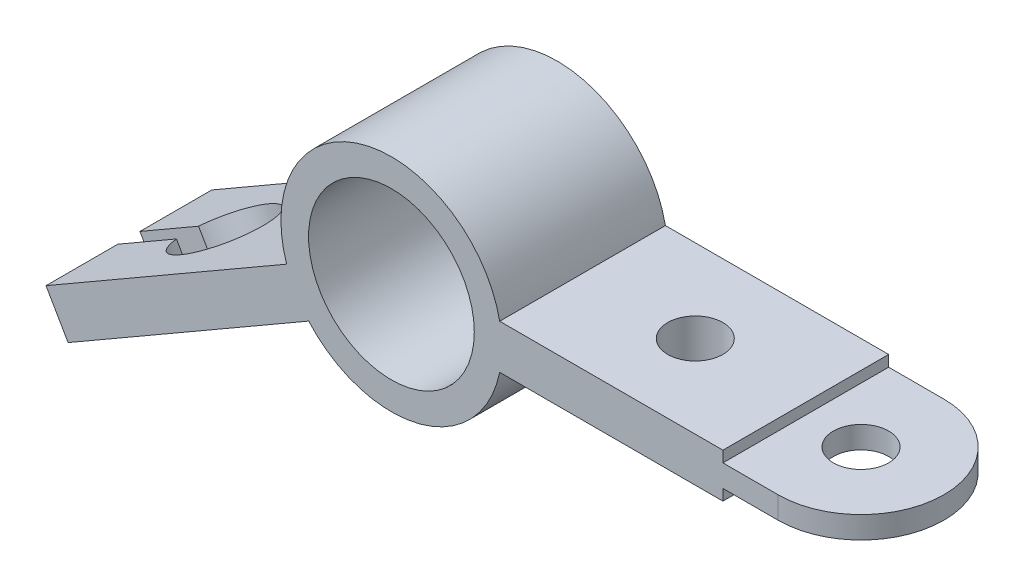
ISO-10303-21;
HEADER;
FILE_DESCRIPTION(('STEP AP214'),'2;1');
FILE_NAME('part.step','',(''),(''),'','','');
FILE_SCHEMA(('AUTOMOTIVE_DESIGN { 1 0 10303 214 1 1 1 1 }'));
ENDSEC;
DATA;
#1=APPLICATION_CONTEXT('core data for automotive mechanical design processes');
#2=APPLICATION_PROTOCOL_DEFINITION('international standard','automotive_design',2000,#1);
#3=PRODUCT_CONTEXT('',#1,'mechanical');
#4=PRODUCT('Part','Part','',(#3));
#5=PRODUCT_RELATED_PRODUCT_CATEGORY('part','',(#4));
#6=PRODUCT_DEFINITION_FORMATION('','',#4);
#7=PRODUCT_DEFINITION_CONTEXT('part definition',#1,'design');
#8=PRODUCT_DEFINITION('design','',#6,#7);
#9=PRODUCT_DEFINITION_SHAPE('','',#8);
#10=(LENGTH_UNIT() NAMED_UNIT(*) SI_UNIT(.MILLI.,.METRE.));
#11=(NAMED_UNIT(*) PLANE_ANGLE_UNIT() SI_UNIT($,.RADIAN.));
#12=(NAMED_UNIT(*) SI_UNIT($,.STERADIAN.) SOLID_ANGLE_UNIT());
#13=UNCERTAINTY_MEASURE_WITH_UNIT(LENGTH_MEASURE(1.E-05),#10,'distance_accuracy_value','');
#14=(GEOMETRIC_REPRESENTATION_CONTEXT(3) GLOBAL_UNCERTAINTY_ASSIGNED_CONTEXT((#13)) GLOBAL_UNIT_ASSIGNED_CONTEXT((#10,
#11,#12)) REPRESENTATION_CONTEXT('',''));
#15=CARTESIAN_POINT('',(0.,0.,0.));
#16=DIRECTION('',(0.,0.,1.));
#17=DIRECTION('',(1.,0.,0.));
#18=AXIS2_PLACEMENT_3D('',#15,#16,#17);
#19=CARTESIAN_POINT('',(-151.30680751374,-87.357026048281,37.5));
#20=DIRECTION('',(-0.866025403784438,-0.500000000000002,0.));
#21=DIRECTION('',(0.500000000000002,-0.866025403784438,0.));
#22=AXIS2_PLACEMENT_3D('',#19,#20,#21);
#23=PLANE('',#22);
#24=DIRECTION('',(0.,0.,-1.));
#25=VECTOR('',#24,1.);
#26=CARTESIAN_POINT('',(-146.30680751374,-96.0172800861254,37.5));
#27=LINE('',#26,#25);
#28=CARTESIAN_POINT('',(-146.30680751374,-96.0172800861254,-5.));
#29=VERTEX_POINT('',#28);
#30=CARTESIAN_POINT('',(-146.30680751374,-96.0172800861254,-37.5));
#31=VERTEX_POINT('',#30);
#32=EDGE_CURVE('E114',#29,#31,#27,.T.);
#33=ORIENTED_EDGE('',*,*,#32,.F.);
#34=DIRECTION('',(-0.500000000000002,0.866025403784438,0.));
#35=VECTOR('',#34,1.);
#36=CARTESIAN_POINT('',(-151.30680751374,-87.357026048281,-5.));
#37=LINE('',#36,#35);
#38=CARTESIAN_POINT('',(-156.30680751374,-78.6967720104366,-5.));
#39=VERTEX_POINT('',#38);
#40=EDGE_CURVE('E54',#29,#39,#37,.T.);
#41=ORIENTED_EDGE('',*,*,#40,.T.);
#42=DIRECTION('',(0.,0.,-1.));
#43=VECTOR('',#42,1.);
#44=CARTESIAN_POINT('',(-156.30680751374,-78.6967720104366,37.5));
#45=LINE('',#44,#43);
#46=CARTESIAN_POINT('',(-156.30680751374,-78.6967720104366,-37.5));
#47=VERTEX_POINT('',#46);
#48=EDGE_CURVE('E234',#39,#47,#45,.T.);
#49=ORIENTED_EDGE('',*,*,#48,.T.);
#50=DIRECTION('',(-0.500000000000002,0.866025403784438,0.));
#51=VECTOR('',#50,1.);
#52=CARTESIAN_POINT('',(-151.30680751374,-87.357026048281,-37.5));
#53=LINE('',#52,#51);
#54=EDGE_CURVE('E223',#31,#47,#53,.T.);
#55=ORIENTED_EDGE('',*,*,#54,.F.);
#56=EDGE_LOOP('',(#33,#41,#49,#55));
#57=FACE_BOUND('',#56,.T.);
#58=ADVANCED_FACE('F45',(#57),#23,.T.);
#59=CARTESIAN_POINT('',(4.99999999999999,-8.66025403784434,37.5));
#60=DIRECTION('',(-0.500000000000002,0.866025403784438,0.));
#61=DIRECTION('',(-0.866025403784438,-0.500000000000002,0.));
#62=AXIS2_PLACEMENT_3D('',#59,#60,#61);
#63=PLANE('',#62);
#64=CARTESIAN_POINT('',(-146.30680751374,-96.0172800861254,37.5));
#65=VERTEX_POINT('',#64);
#66=CARTESIAN_POINT('',(-146.30680751374,-96.0172800861254,5.));
#67=VERTEX_POINT('',#66);
#68=EDGE_CURVE('E70',#65,#67,#27,.T.);
#69=ORIENTED_EDGE('',*,*,#68,.T.);
#70=DIRECTION('',(0.866025403784438,0.500000000000002,0.));
#71=VECTOR('',#70,1.);
#72=CARTESIAN_POINT('',(4.99999999999999,-8.66025403784434,5.));
#73=LINE('',#72,#71);
#74=CARTESIAN_POINT('',(-119.776047155766,-80.6997384516438,5.));
#75=VERTEX_POINT('',#74);
#76=EDGE_CURVE('E342',#67,#75,#73,.T.);
#77=ORIENTED_EDGE('',*,*,#76,.T.);
#78=CARTESIAN_POINT('',(-103.005537324518,-71.0172800861253,0.));
#79=DIRECTION('',(-0.500000000000002,0.866025403784438,0.));
#80=DIRECTION('',(-0.866025403784438,-0.500000000000002,0.));
#81=AXIS2_PLACEMENT_3D('',#78,#79,#80);
#82=CIRCLE('',#81,20.);
#83=CARTESIAN_POINT('',(-119.776047155766,-80.6997384516438,-5.00000000000001));
#84=VERTEX_POINT('',#83);
#85=EDGE_CURVE('E338',#75,#84,#82,.T.);
#86=ORIENTED_EDGE('',*,*,#85,.T.);
#87=DIRECTION('',(0.866025403784438,0.500000000000002,0.));
#88=VECTOR('',#87,1.);
#89=CARTESIAN_POINT('',(4.99999999999999,-8.66025403784434,-5.));
#90=LINE('',#89,#88);
#91=EDGE_CURVE('E346',#29,#84,#90,.T.);
#92=ORIENTED_EDGE('',*,*,#91,.F.);
#93=ORIENTED_EDGE('',*,*,#32,.T.);
#94=DIRECTION('',(0.866025403784438,0.500000000000002,0.));
#95=VECTOR('',#94,1.);
#96=CARTESIAN_POINT('',(4.99999999999999,-8.66025403784434,-37.5));
#97=LINE('',#96,#95);
#98=CARTESIAN_POINT('',(-37.4264068711928,-33.1551514656762,-37.5));
#99=VERTEX_POINT('',#98);
#100=EDGE_CURVE('E189',#31,#99,#97,.T.);
#101=ORIENTED_EDGE('',*,*,#100,.T.);
#102=DIRECTION('',(0.,0.,-1.));
#103=VECTOR('',#102,1.);
#104=CARTESIAN_POINT('',(-37.4264068711928,-33.1551514656762,37.5));
#105=LINE('',#104,#103);
#106=CARTESIAN_POINT('',(-37.4264068711928,-33.1551514656762,37.5));
#107=VERTEX_POINT('',#106);
#108=EDGE_CURVE('E256',#107,#99,#105,.T.);
#109=ORIENTED_EDGE('',*,*,#108,.F.);
#110=DIRECTION('',(0.866025403784438,0.500000000000002,0.));
#111=VECTOR('',#110,1.);
#112=CARTESIAN_POINT('',(4.99999999999999,-8.66025403784434,37.5));
#113=LINE('',#112,#111);
#114=EDGE_CURVE('E231',#65,#107,#113,.T.);
#115=ORIENTED_EDGE('',*,*,#114,.F.);
#116=EDGE_LOOP('',(#69,#77,#86,#92,#93,#101,#109,#115));
#117=FACE_BOUND('',#116,.T.);
#118=ADVANCED_FACE('F47',(#117),#63,.F.);
#119=CARTESIAN_POINT('',(0.,0.,37.5));
#120=DIRECTION('',(0.,0.,-1.));
#121=DIRECTION('',(-1.,0.,0.));
#122=AXIS2_PLACEMENT_3D('',#119,#120,#121);
#123=CYLINDRICAL_SURFACE('',#122,50.);
#124=CARTESIAN_POINT('',(0.,0.,-37.5));
#125=DIRECTION('',(0.,0.,1.));
#126=DIRECTION('',(1.,0.,0.));
#127=AXIS2_PLACEMENT_3D('',#124,#125,#126);
#128=CIRCLE('',#127,50.);
#129=CARTESIAN_POINT('',(48.9897948556636,-10.,-37.5));
#130=VERTEX_POINT('',#129);
#131=EDGE_CURVE('E192',#99,#130,#128,.T.);
#132=ORIENTED_EDGE('',*,*,#131,.T.);
#133=DIRECTION('',(0.,0.,-1.));
#134=VECTOR('',#133,1.);
#135=CARTESIAN_POINT('',(48.9897948556636,-10.,37.5));
#136=LINE('',#135,#134);
#137=CARTESIAN_POINT('',(48.9897948556636,-10.,37.5));
#138=VERTEX_POINT('',#137);
#139=EDGE_CURVE('E253',#138,#130,#136,.T.);
#140=ORIENTED_EDGE('',*,*,#139,.F.);
#141=CARTESIAN_POINT('',(0.,0.,37.5));
#142=DIRECTION('',(0.,0.,1.));
#143=DIRECTION('',(1.,0.,0.));
#144=AXIS2_PLACEMENT_3D('',#141,#142,#143);
#145=CIRCLE('',#144,50.);
#146=EDGE_CURVE('E123',#107,#138,#145,.T.);
#147=ORIENTED_EDGE('',*,*,#146,.F.);
#148=ORIENTED_EDGE('',*,*,#108,.T.);
#149=EDGE_LOOP('',(#132,#140,#147,#148));
#150=FACE_BOUND('',#149,.T.);
#151=ADVANCED_FACE('F272',(#150),#123,.T.);
#152=CARTESIAN_POINT('',(0.,-10.,37.5));
#153=DIRECTION('',(0.,-1.,0.));
#154=DIRECTION('',(1.,0.,0.));
#155=AXIS2_PLACEMENT_3D('',#152,#153,#154);
#156=PLANE('',#155);
#157=CARTESIAN_POINT('',(100.,-10.,0.));
#158=DIRECTION('',(0.,-1.,0.));
#159=DIRECTION('',(1.,0.,0.));
#160=AXIS2_PLACEMENT_3D('',#157,#158,#159);
#161=CIRCLE('',#160,12.5);
#162=CARTESIAN_POINT('',(112.5,-10.,0.));
#163=VERTEX_POINT('',#162);
#164=EDGE_CURVE('E330',#163,#163,#161,.T.);
#165=ORIENTED_EDGE('',*,*,#164,.F.);
#166=EDGE_LOOP('',(#165));
#167=FACE_BOUND('',#166,.T.);
#168=DIRECTION('',(-1.,0.,0.));
#169=VECTOR('',#168,1.);
#170=CARTESIAN_POINT('',(0.,-10.,-37.5));
#171=LINE('',#170,#169);
#172=CARTESIAN_POINT('',(150.,-10.,-37.5));
#173=VERTEX_POINT('',#172);
#174=EDGE_CURVE('E197',#173,#130,#171,.T.);
#175=ORIENTED_EDGE('',*,*,#174,.F.);
#176=DIRECTION('',(0.,0.,-1.));
#177=VECTOR('',#176,1.);
#178=CARTESIAN_POINT('',(150.,-10.,37.5));
#179=LINE('',#178,#177);
#180=CARTESIAN_POINT('',(150.,-10.,37.5));
#181=VERTEX_POINT('',#180);
#182=EDGE_CURVE('E250',#181,#173,#179,.T.);
#183=ORIENTED_EDGE('',*,*,#182,.F.);
#184=DIRECTION('',(-1.,0.,0.));
#185=VECTOR('',#184,1.);
#186=CARTESIAN_POINT('',(0.,-10.,37.5));
#187=LINE('',#186,#185);
#188=EDGE_CURVE('E281',#181,#138,#187,.T.);
#189=ORIENTED_EDGE('',*,*,#188,.T.);
#190=ORIENTED_EDGE('',*,*,#139,.T.);
#191=EDGE_LOOP('',(#175,#183,#189,#190));
#192=FACE_BOUND('',#191,.T.);
#193=ADVANCED_FACE('F278',(#167,#192),#156,.T.);
#194=CARTESIAN_POINT('',(150.,0.,37.5));
#195=DIRECTION('',(-1.,0.,0.));
#196=DIRECTION('',(0.,0.,1.));
#197=AXIS2_PLACEMENT_3D('',#194,#195,#196);
#198=PLANE('',#197);
#199=DIRECTION('',(0.,1.,0.));
#200=VECTOR('',#199,1.);
#201=CARTESIAN_POINT('',(150.,0.,-37.5));
#202=LINE('',#201,#200);
#203=CARTESIAN_POINT('',(150.,-5.,-37.5));
#204=VERTEX_POINT('',#203);
#205=EDGE_CURVE('E201',#173,#204,#202,.T.);
#206=ORIENTED_EDGE('',*,*,#205,.T.);
#207=DIRECTION('',(0.,0.,-1.));
#208=VECTOR('',#207,1.);
#209=CARTESIAN_POINT('',(150.,-5.,37.5));
#210=LINE('',#209,#208);
#211=CARTESIAN_POINT('',(150.,-5.,37.5));
#212=VERTEX_POINT('',#211);
#213=EDGE_CURVE('E246',#212,#204,#210,.T.);
#214=ORIENTED_EDGE('',*,*,#213,.F.);
#215=DIRECTION('',(0.,1.,0.));
#216=VECTOR('',#215,1.);
#217=CARTESIAN_POINT('',(150.,0.,37.5));
#218=LINE('',#217,#216);
#219=EDGE_CURVE('E283',#181,#212,#218,.T.);
#220=ORIENTED_EDGE('',*,*,#219,.F.);
#221=ORIENTED_EDGE('',*,*,#182,.T.);
#222=EDGE_LOOP('',(#206,#214,#220,#221));
#223=FACE_BOUND('',#222,.T.);
#224=ADVANCED_FACE('F405',(#223),#198,.F.);
#225=CARTESIAN_POINT('',(0.,-5.,37.5));
#226=DIRECTION('',(0.,1.,0.));
#227=DIRECTION('',(0.,0.,1.));
#228=AXIS2_PLACEMENT_3D('',#225,#226,#227);
#229=PLANE('',#228);
#230=CARTESIAN_POINT('',(175.,-5.,0.));
#231=DIRECTION('',(0.,1.,0.));
#232=DIRECTION('',(0.,0.,1.));
#233=AXIS2_PLACEMENT_3D('',#230,#231,#232);
#234=CIRCLE('',#233,12.5);
#235=CARTESIAN_POINT('',(175.,-5.,12.5));
#236=VERTEX_POINT('',#235);
#237=EDGE_CURVE('E322',#236,#236,#234,.T.);
#238=ORIENTED_EDGE('',*,*,#237,.T.);
#239=EDGE_LOOP('',(#238));
#240=FACE_BOUND('',#239,.T.);
#241=DIRECTION('',(1.,0.,0.));
#242=VECTOR('',#241,1.);
#243=CARTESIAN_POINT('',(0.,-5.,-37.5));
#244=LINE('',#243,#242);
#245=CARTESIAN_POINT('',(175.,-5.,-37.5));
#246=VERTEX_POINT('',#245);
#247=EDGE_CURVE('E204',#204,#246,#244,.T.);
#248=ORIENTED_EDGE('',*,*,#247,.T.);
#249=CARTESIAN_POINT('',(175.,-5.,0.));
#250=DIRECTION('',(0.,1.,0.));
#251=DIRECTION('',(0.,0.,-1.));
#252=AXIS2_PLACEMENT_3D('',#249,#250,#251);
#253=CIRCLE('',#252,37.5);
#254=CARTESIAN_POINT('',(175.,-5.,37.5));
#255=VERTEX_POINT('',#254);
#256=EDGE_CURVE('E193',#255,#246,#253,.T.);
#257=ORIENTED_EDGE('',*,*,#256,.F.);
#258=DIRECTION('',(1.,0.,0.));
#259=VECTOR('',#258,1.);
#260=CARTESIAN_POINT('',(0.,-5.,37.5));
#261=LINE('',#260,#259);
#262=EDGE_CURVE('E287',#212,#255,#261,.T.);
#263=ORIENTED_EDGE('',*,*,#262,.F.);
#264=ORIENTED_EDGE('',*,*,#213,.T.);
#265=EDGE_LOOP('',(#248,#257,#263,#264));
#266=FACE_BOUND('',#265,.T.);
#267=ADVANCED_FACE('F395',(#240,#266),#229,.F.);
#268=CARTESIAN_POINT('',(0.,5.,37.5));
#269=DIRECTION('',(0.,1.,0.));
#270=DIRECTION('',(0.,0.,1.));
#271=AXIS2_PLACEMENT_3D('',#268,#269,#270);
#272=PLANE('',#271);
#273=CARTESIAN_POINT('',(175.,5.,0.));
#274=DIRECTION('',(0.,1.,0.));
#275=DIRECTION('',(0.,0.,1.));
#276=AXIS2_PLACEMENT_3D('',#273,#274,#275);
#277=CIRCLE('',#276,12.5);
#278=CARTESIAN_POINT('',(175.,5.,12.5));
#279=VERTEX_POINT('',#278);
#280=EDGE_CURVE('E326',#279,#279,#277,.T.);
#281=ORIENTED_EDGE('',*,*,#280,.F.);
#282=EDGE_LOOP('',(#281));
#283=FACE_BOUND('',#282,.T.);
#284=DIRECTION('',(1.,0.,0.));
#285=VECTOR('',#284,1.);
#286=CARTESIAN_POINT('',(0.,5.,-37.5));
#287=LINE('',#286,#285);
#288=CARTESIAN_POINT('',(150.,5.,-37.5));
#289=VERTEX_POINT('',#288);
#290=CARTESIAN_POINT('',(175.,5.,-37.5));
#291=VERTEX_POINT('',#290);
#292=EDGE_CURVE('E213',#289,#291,#287,.T.);
#293=ORIENTED_EDGE('',*,*,#292,.F.);
#294=DIRECTION('',(0.,0.,-1.));
#295=VECTOR('',#294,1.);
#296=CARTESIAN_POINT('',(150.,5.,37.5));
#297=LINE('',#296,#295);
#298=CARTESIAN_POINT('',(150.,5.,37.5));
#299=VERTEX_POINT('',#298);
#300=EDGE_CURVE('E243',#299,#289,#297,.T.);
#301=ORIENTED_EDGE('',*,*,#300,.F.);
#302=DIRECTION('',(1.,0.,0.));
#303=VECTOR('',#302,1.);
#304=CARTESIAN_POINT('',(0.,5.,37.5));
#305=LINE('',#304,#303);
#306=CARTESIAN_POINT('',(175.,5.,37.5));
#307=VERTEX_POINT('',#306);
#308=EDGE_CURVE('E298',#299,#307,#305,.T.);
#309=ORIENTED_EDGE('',*,*,#308,.T.);
#310=CARTESIAN_POINT('',(175.,5.,0.));
#311=DIRECTION('',(0.,1.,0.));
#312=DIRECTION('',(0.,0.,-1.));
#313=AXIS2_PLACEMENT_3D('',#310,#311,#312);
#314=CIRCLE('',#313,37.5);
#315=EDGE_CURVE('E319',#307,#291,#314,.T.);
#316=ORIENTED_EDGE('',*,*,#315,.T.);
#317=EDGE_LOOP('',(#293,#301,#309,#316));
#318=FACE_BOUND('',#317,.T.);
#319=ADVANCED_FACE('F396',(#283,#318),#272,.T.);
#320=CARTESIAN_POINT('',(150.,10.,-37.5));
#321=VERTEX_POINT('',#320);
#322=EDGE_CURVE('E205',#289,#321,#202,.T.);
#323=ORIENTED_EDGE('',*,*,#322,.T.);
#324=DIRECTION('',(0.,0.,-1.));
#325=VECTOR('',#324,1.);
#326=CARTESIAN_POINT('',(150.,10.,37.5));
#327=LINE('',#326,#325);
#328=CARTESIAN_POINT('',(150.,10.,37.5));
#329=VERTEX_POINT('',#328);
#330=EDGE_CURVE('E239',#329,#321,#327,.T.);
#331=ORIENTED_EDGE('',*,*,#330,.F.);
#332=EDGE_CURVE('E289',#299,#329,#218,.T.);
#333=ORIENTED_EDGE('',*,*,#332,.F.);
#334=ORIENTED_EDGE('',*,*,#300,.T.);
#335=EDGE_LOOP('',(#323,#331,#333,#334));
#336=FACE_BOUND('',#335,.T.);
#337=ADVANCED_FACE('F310',(#336),#198,.F.);
#338=CARTESIAN_POINT('',(0.,10.,37.5));
#339=DIRECTION('',(0.,-1.,0.));
#340=DIRECTION('',(1.,0.,0.));
#341=AXIS2_PLACEMENT_3D('',#338,#339,#340);
#342=PLANE('',#341);
#343=CARTESIAN_POINT('',(100.,10.,0.));
#344=DIRECTION('',(0.,1.,0.));
#345=DIRECTION('',(-1.,0.,0.));
#346=AXIS2_PLACEMENT_3D('',#343,#344,#345);
#347=CIRCLE('',#346,12.5);
#348=CARTESIAN_POINT('',(87.5,10.,0.));
#349=VERTEX_POINT('',#348);
#350=EDGE_CURVE('E334',#349,#349,#347,.T.);
#351=ORIENTED_EDGE('',*,*,#350,.F.);
#352=EDGE_LOOP('',(#351));
#353=FACE_BOUND('',#352,.T.);
#354=DIRECTION('',(-1.,0.,0.));
#355=VECTOR('',#354,1.);
#356=CARTESIAN_POINT('',(0.,10.,-37.5));
#357=LINE('',#356,#355);
#358=CARTESIAN_POINT('',(48.9897948556636,10.,-37.5));
#359=VERTEX_POINT('',#358);
#360=EDGE_CURVE('E217',#321,#359,#357,.T.);
#361=ORIENTED_EDGE('',*,*,#360,.T.);
#362=DIRECTION('',(0.,0.,-1.));
#363=VECTOR('',#362,1.);
#364=CARTESIAN_POINT('',(48.9897948556636,10.,37.5));
#365=LINE('',#364,#363);
#366=CARTESIAN_POINT('',(48.9897948556636,10.,37.5));
#367=VERTEX_POINT('',#366);
#368=EDGE_CURVE('E171',#367,#359,#365,.T.);
#369=ORIENTED_EDGE('',*,*,#368,.F.);
#370=DIRECTION('',(-1.,0.,0.));
#371=VECTOR('',#370,1.);
#372=CARTESIAN_POINT('',(0.,10.,37.5));
#373=LINE('',#372,#371);
#374=EDGE_CURVE('E156',#329,#367,#373,.T.);
#375=ORIENTED_EDGE('',*,*,#374,.F.);
#376=ORIENTED_EDGE('',*,*,#330,.T.);
#377=EDGE_LOOP('',(#361,#369,#375,#376));
#378=FACE_BOUND('',#377,.T.);
#379=ADVANCED_FACE('F314',(#353,#378),#342,.F.);
#380=CARTESIAN_POINT('',(-47.4264068711928,-15.8346433899875,-37.5));
#381=VERTEX_POINT('',#380);
#382=EDGE_CURVE('E166',#359,#381,#128,.T.);
#383=ORIENTED_EDGE('',*,*,#382,.T.);
#384=DIRECTION('',(0.,0.,-1.));
#385=VECTOR('',#384,1.);
#386=CARTESIAN_POINT('',(-47.4264068711928,-15.8346433899875,37.5));
#387=LINE('',#386,#385);
#388=CARTESIAN_POINT('',(-47.4264068711928,-15.8346433899875,37.5));
#389=VERTEX_POINT('',#388);
#390=EDGE_CURVE('E163',#389,#381,#387,.T.);
#391=ORIENTED_EDGE('',*,*,#390,.F.);
#392=EDGE_CURVE('E148',#367,#389,#145,.T.);
#393=ORIENTED_EDGE('',*,*,#392,.F.);
#394=ORIENTED_EDGE('',*,*,#368,.T.);
#395=EDGE_LOOP('',(#383,#391,#393,#394));
#396=FACE_BOUND('',#395,.T.);
#397=ADVANCED_FACE('F164',(#396),#123,.T.);
#398=CARTESIAN_POINT('',(-4.99999999999999,8.66025403784434,37.5));
#399=DIRECTION('',(-0.500000000000001,0.866025403784438,0.));
#400=DIRECTION('',(-0.866025403784438,-0.500000000000001,0.));
#401=AXIS2_PLACEMENT_3D('',#398,#399,#400);
#402=PLANE('',#401);
#403=DIRECTION('',(0.866025403784438,0.500000000000002,0.));
#404=VECTOR('',#403,1.);
#405=CARTESIAN_POINT('',(-156.30680751374,-78.6967720104365,5.));
#406=LINE('',#405,#404);
#407=CARTESIAN_POINT('',(-156.30680751374,-78.6967720104365,5.));
#408=VERTEX_POINT('',#407);
#409=CARTESIAN_POINT('',(-129.776047155766,-63.3792303759551,5.));
#410=VERTEX_POINT('',#409);
#411=EDGE_CURVE('E362',#408,#410,#406,.T.);
#412=ORIENTED_EDGE('',*,*,#411,.F.);
#413=CARTESIAN_POINT('',(-156.30680751374,-78.6967720104366,37.5));
#414=VERTEX_POINT('',#413);
#415=EDGE_CURVE('E172',#414,#408,#45,.T.);
#416=ORIENTED_EDGE('',*,*,#415,.F.);
#417=DIRECTION('',(0.866025403784438,0.500000000000001,0.));
#418=VECTOR('',#417,1.);
#419=CARTESIAN_POINT('',(-4.99999999999999,8.66025403784434,37.5));
#420=LINE('',#419,#418);
#421=EDGE_CURVE('E154',#414,#389,#420,.T.);
#422=ORIENTED_EDGE('',*,*,#421,.T.);
#423=ORIENTED_EDGE('',*,*,#390,.T.);
#424=DIRECTION('',(0.866025403784438,0.500000000000001,0.));
#425=VECTOR('',#424,1.);
#426=CARTESIAN_POINT('',(-4.99999999999999,8.66025403784434,-37.5));
#427=LINE('',#426,#425);
#428=EDGE_CURVE('E220',#47,#381,#427,.T.);
#429=ORIENTED_EDGE('',*,*,#428,.F.);
#430=ORIENTED_EDGE('',*,*,#48,.F.);
#431=DIRECTION('',(0.866025403784438,0.500000000000002,0.));
#432=VECTOR('',#431,1.);
#433=CARTESIAN_POINT('',(-156.30680751374,-78.6967720104365,-5.));
#434=LINE('',#433,#432);
#435=CARTESIAN_POINT('',(-129.776047155766,-63.3792303759551,-5.00000000000001));
#436=VERTEX_POINT('',#435);
#437=EDGE_CURVE('E61',#39,#436,#434,.T.);
#438=ORIENTED_EDGE('',*,*,#437,.T.);
#439=CARTESIAN_POINT('',(-113.005537324518,-53.6967720104365,0.));
#440=DIRECTION('',(-0.500000000000001,0.866025403784438,0.));
#441=DIRECTION('',(-0.866025403784438,-0.500000000000001,0.));
#442=AXIS2_PLACEMENT_3D('',#439,#440,#441);
#443=CIRCLE('',#442,20.);
#444=EDGE_CURVE('E358',#410,#436,#443,.T.);
#445=ORIENTED_EDGE('',*,*,#444,.F.);
#446=EDGE_LOOP('',(#412,#416,#422,#423,#429,#430,#438,#445));
#447=FACE_BOUND('',#446,.T.);
#448=ADVANCED_FACE('F175',(#447),#402,.T.);
#449=DIRECTION('',(-0.500000000000002,0.866025403784438,0.));
#450=VECTOR('',#449,1.);
#451=CARTESIAN_POINT('',(-151.30680751374,-87.357026048281,5.));
#452=LINE('',#451,#450);
#453=EDGE_CURVE('E11',#67,#408,#452,.T.);
#454=ORIENTED_EDGE('',*,*,#453,.F.);
#455=ORIENTED_EDGE('',*,*,#68,.F.);
#456=DIRECTION('',(-0.500000000000002,0.866025403784438,0.));
#457=VECTOR('',#456,1.);
#458=CARTESIAN_POINT('',(-151.30680751374,-87.357026048281,37.5));
#459=LINE('',#458,#457);
#460=EDGE_CURVE('E178',#65,#414,#459,.T.);
#461=ORIENTED_EDGE('',*,*,#460,.T.);
#462=ORIENTED_EDGE('',*,*,#415,.T.);
#463=EDGE_LOOP('',(#454,#455,#461,#462));
#464=FACE_BOUND('',#463,.T.);
#465=ADVANCED_FACE('F370',(#464),#23,.T.);
#466=CARTESIAN_POINT('',(0.,0.,37.5));
#467=DIRECTION('',(0.,0.,-1.));
#468=DIRECTION('',(-1.,0.,0.));
#469=AXIS2_PLACEMENT_3D('',#466,#467,#468);
#470=CYLINDRICAL_SURFACE('',#469,37.5);
#471=CARTESIAN_POINT('',(0.,0.,37.5));
#472=DIRECTION('',(0.,0.,1.));
#473=DIRECTION('',(1.,0.,0.));
#474=AXIS2_PLACEMENT_3D('',#471,#472,#473);
#475=CIRCLE('',#474,37.5);
#476=CARTESIAN_POINT('',(37.5,0.,37.5));
#477=VERTEX_POINT('',#476);
#478=EDGE_CURVE('E181',#477,#477,#475,.T.);
#479=ORIENTED_EDGE('',*,*,#478,.T.);
#480=EDGE_LOOP('',(#479));
#481=FACE_BOUND('',#480,.T.);
#482=CARTESIAN_POINT('',(0.,0.,-37.5));
#483=DIRECTION('',(0.,0.,1.));
#484=DIRECTION('',(1.,0.,0.));
#485=AXIS2_PLACEMENT_3D('',#482,#483,#484);
#486=CIRCLE('',#485,37.5);
#487=CARTESIAN_POINT('',(37.5,0.,-37.5));
#488=VERTEX_POINT('',#487);
#489=EDGE_CURVE('E227',#488,#488,#486,.T.);
#490=ORIENTED_EDGE('',*,*,#489,.F.);
#491=EDGE_LOOP('',(#490));
#492=FACE_BOUND('',#491,.T.);
#493=ADVANCED_FACE('F417',(#481,#492),#470,.F.);
#494=CARTESIAN_POINT('',(0.,0.,37.5));
#495=DIRECTION('',(0.,0.,1.));
#496=DIRECTION('',(1.,0.,0.));
#497=AXIS2_PLACEMENT_3D('',#494,#495,#496);
#498=PLANE('',#497);
#499=ORIENTED_EDGE('',*,*,#114,.T.);
#500=ORIENTED_EDGE('',*,*,#146,.T.);
#501=ORIENTED_EDGE('',*,*,#188,.F.);
#502=ORIENTED_EDGE('',*,*,#219,.T.);
#503=ORIENTED_EDGE('',*,*,#262,.T.);
#504=DIRECTION('',(0.,-1.,0.));
#505=VECTOR('',#504,1.);
#506=CARTESIAN_POINT('',(175.,0.,37.5));
#507=LINE('',#506,#505);
#508=EDGE_CURVE('E295',#307,#255,#507,.T.);
#509=ORIENTED_EDGE('',*,*,#508,.F.);
#510=ORIENTED_EDGE('',*,*,#308,.F.);
#511=ORIENTED_EDGE('',*,*,#332,.T.);
#512=ORIENTED_EDGE('',*,*,#374,.T.);
#513=ORIENTED_EDGE('',*,*,#392,.T.);
#514=ORIENTED_EDGE('',*,*,#421,.F.);
#515=ORIENTED_EDGE('',*,*,#460,.F.);
#516=EDGE_LOOP('',(#499,#500,#501,#502,#503,#509,#510,#511,#512,#513,#514,#515));
#517=FACE_BOUND('',#516,.T.);
#518=ORIENTED_EDGE('',*,*,#478,.F.);
#519=EDGE_LOOP('',(#518));
#520=FACE_BOUND('',#519,.T.);
#521=ADVANCED_FACE('F150',(#517,#520),#498,.T.);
#522=CARTESIAN_POINT('',(0.,0.,-37.5));
#523=DIRECTION('',(0.,0.,1.));
#524=DIRECTION('',(1.,0.,0.));
#525=AXIS2_PLACEMENT_3D('',#522,#523,#524);
#526=PLANE('',#525);
#527=ORIENTED_EDGE('',*,*,#100,.F.);
#528=ORIENTED_EDGE('',*,*,#54,.T.);
#529=ORIENTED_EDGE('',*,*,#428,.T.);
#530=ORIENTED_EDGE('',*,*,#382,.F.);
#531=ORIENTED_EDGE('',*,*,#360,.F.);
#532=ORIENTED_EDGE('',*,*,#322,.F.);
#533=ORIENTED_EDGE('',*,*,#292,.T.);
#534=DIRECTION('',(0.,-1.,0.));
#535=VECTOR('',#534,1.);
#536=CARTESIAN_POINT('',(175.,0.,-37.5));
#537=LINE('',#536,#535);
#538=EDGE_CURVE('E209',#291,#246,#537,.T.);
#539=ORIENTED_EDGE('',*,*,#538,.T.);
#540=ORIENTED_EDGE('',*,*,#247,.F.);
#541=ORIENTED_EDGE('',*,*,#205,.F.);
#542=ORIENTED_EDGE('',*,*,#174,.T.);
#543=ORIENTED_EDGE('',*,*,#131,.F.);
#544=EDGE_LOOP('',(#527,#528,#529,#530,#531,#532,#533,#539,#540,#541,#542,#543));
#545=FACE_BOUND('',#544,.T.);
#546=ORIENTED_EDGE('',*,*,#489,.T.);
#547=EDGE_LOOP('',(#546));
#548=FACE_BOUND('',#547,.T.);
#549=ADVANCED_FACE('F269',(#545,#548),#526,.F.);
#550=CARTESIAN_POINT('',(175.,-5.,0.));
#551=DIRECTION('',(0.,1.,0.));
#552=DIRECTION('',(0.,0.,1.));
#553=AXIS2_PLACEMENT_3D('',#550,#551,#552);
#554=CYLINDRICAL_SURFACE('',#553,37.5);
#555=ORIENTED_EDGE('',*,*,#315,.F.);
#556=ORIENTED_EDGE('',*,*,#508,.T.);
#557=ORIENTED_EDGE('',*,*,#256,.T.);
#558=ORIENTED_EDGE('',*,*,#538,.F.);
#559=EDGE_LOOP('',(#555,#556,#557,#558));
#560=FACE_BOUND('',#559,.T.);
#561=ADVANCED_FACE('F389',(#560),#554,.T.);
#562=CARTESIAN_POINT('',(175.,-5.,0.));
#563=DIRECTION('',(0.,1.,0.));
#564=DIRECTION('',(0.,0.,1.));
#565=AXIS2_PLACEMENT_3D('',#562,#563,#564);
#566=CYLINDRICAL_SURFACE('',#565,12.5);
#567=ORIENTED_EDGE('',*,*,#237,.F.);
#568=EDGE_LOOP('',(#567));
#569=FACE_BOUND('',#568,.T.);
#570=ORIENTED_EDGE('',*,*,#280,.T.);
#571=EDGE_LOOP('',(#570));
#572=FACE_BOUND('',#571,.T.);
#573=ADVANCED_FACE('F437',(#569,#572),#566,.F.);
#574=CARTESIAN_POINT('',(100.,-96.0172800861254,0.));
#575=DIRECTION('',(0.,1.,0.));
#576=DIRECTION('',(-1.,0.,0.));
#577=AXIS2_PLACEMENT_3D('',#574,#575,#576);
#578=CYLINDRICAL_SURFACE('',#577,12.5);
#579=ORIENTED_EDGE('',*,*,#164,.T.);
#580=EDGE_LOOP('',(#579));
#581=FACE_BOUND('',#580,.T.);
#582=ORIENTED_EDGE('',*,*,#350,.T.);
#583=EDGE_LOOP('',(#582));
#584=FACE_BOUND('',#583,.T.);
#585=ADVANCED_FACE('F434',(#581,#584),#578,.F.);
#586=CARTESIAN_POINT('',(-13.3038354460826,-226.385185264972,0.));
#587=DIRECTION('',(-0.500000000000001,0.866025403784438,0.));
#588=DIRECTION('',(-0.866025403784438,-0.500000000000001,0.));
#589=AXIS2_PLACEMENT_3D('',#586,#587,#588);
#590=CYLINDRICAL_SURFACE('',#589,20.);
#591=DIRECTION('',(-0.500000000000001,0.866025403784438,0.));
#592=VECTOR('',#591,1.);
#593=CARTESIAN_POINT('',(-30.074345277331,-236.06764363049,5.));
#594=LINE('',#593,#592);
#595=EDGE_CURVE('E352',#75,#410,#594,.T.);
#596=ORIENTED_EDGE('',*,*,#595,.T.);
#597=ORIENTED_EDGE('',*,*,#444,.T.);
#598=DIRECTION('',(-0.500000000000001,0.866025403784438,0.));
#599=VECTOR('',#598,1.);
#600=CARTESIAN_POINT('',(-30.074345277331,-236.06764363049,-5.00000000000001));
#601=LINE('',#600,#599);
#602=EDGE_CURVE('E349',#84,#436,#601,.T.);
#603=ORIENTED_EDGE('',*,*,#602,.F.);
#604=ORIENTED_EDGE('',*,*,#85,.F.);
#605=EDGE_LOOP('',(#596,#597,#603,#604));
#606=FACE_BOUND('',#605,.T.);
#607=ADVANCED_FACE('F436',(#606),#590,.F.);
#608=CARTESIAN_POINT('',(-56.6051056353045,-251.385185264972,5.));
#609=DIRECTION('',(0.,0.,1.));
#610=DIRECTION('',(1.,0.,0.));
#611=AXIS2_PLACEMENT_3D('',#608,#609,#610);
#612=PLANE('',#611);
#613=ORIENTED_EDGE('',*,*,#453,.T.);
#614=ORIENTED_EDGE('',*,*,#411,.T.);
#615=ORIENTED_EDGE('',*,*,#595,.F.);
#616=ORIENTED_EDGE('',*,*,#76,.F.);
#617=EDGE_LOOP('',(#613,#614,#615,#616));
#618=FACE_BOUND('',#617,.T.);
#619=ADVANCED_FACE('F444',(#618),#612,.F.);
#620=CARTESIAN_POINT('',(-56.6051056353045,-251.385185264972,-5.));
#621=DIRECTION('',(0.,0.,1.));
#622=DIRECTION('',(1.,0.,0.));
#623=AXIS2_PLACEMENT_3D('',#620,#621,#622);
#624=PLANE('',#623);
#625=ORIENTED_EDGE('',*,*,#91,.T.);
#626=ORIENTED_EDGE('',*,*,#602,.T.);
#627=ORIENTED_EDGE('',*,*,#437,.F.);
#628=ORIENTED_EDGE('',*,*,#40,.F.);
#629=EDGE_LOOP('',(#625,#626,#627,#628));
#630=FACE_BOUND('',#629,.T.);
#631=ADVANCED_FACE('F535',(#630),#624,.T.);
#632=CLOSED_SHELL('',(#58,#118,#151,#193,#224,#267,#319,#337,#379,#397,#448,#465,#493,#521,#549,
#561,#573,#585,#607,#619,#631));
#633=MANIFOLD_SOLID_BREP('B2',#632);
#634=ADVANCED_BREP_SHAPE_REPRESENTATION('',(#18,#633),#14);
#635=SHAPE_DEFINITION_REPRESENTATION(#9,#634);
ENDSEC;
END-ISO-10303-21;
